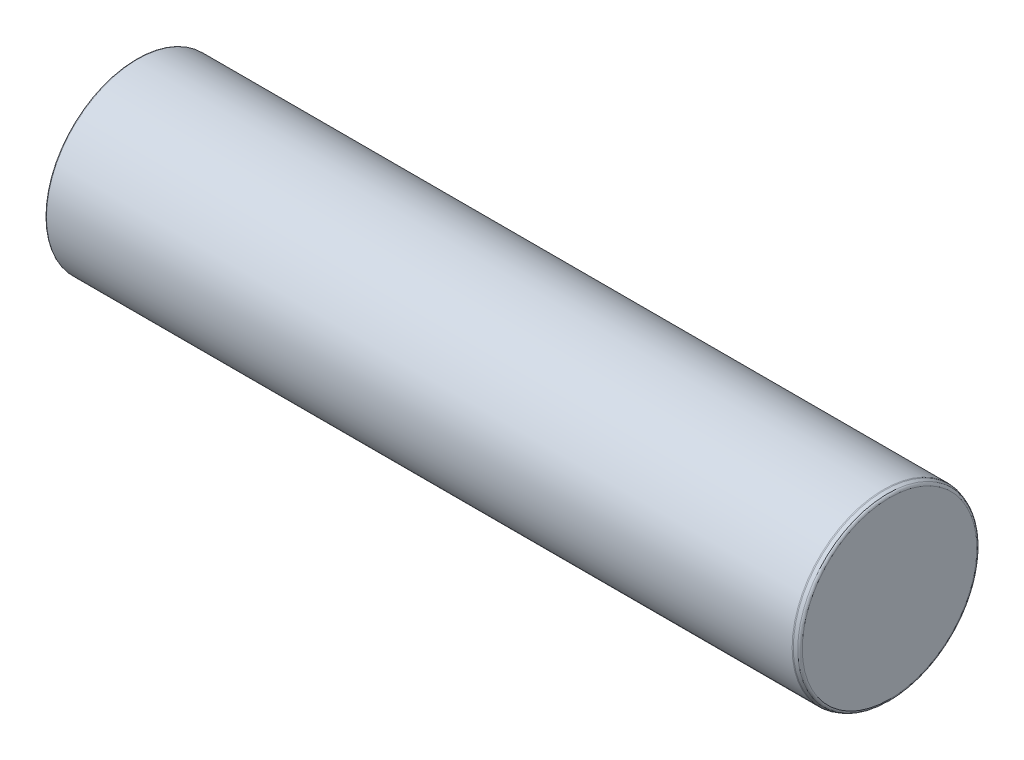
ISO-10303-21;
HEADER;
FILE_DESCRIPTION(('STEP AP214'),'2;1');
FILE_NAME('part.step','',(''),(''),'','','');
FILE_SCHEMA(('AUTOMOTIVE_DESIGN { 1 0 10303 214 1 1 1 1 }'));
ENDSEC;
DATA;
#1=APPLICATION_CONTEXT('core data for automotive mechanical design processes');
#2=APPLICATION_PROTOCOL_DEFINITION('international standard','automotive_design',2000,#1);
#3=PRODUCT_CONTEXT('',#1,'mechanical');
#4=PRODUCT('Part','Part','',(#3));
#5=PRODUCT_RELATED_PRODUCT_CATEGORY('part','',(#4));
#6=PRODUCT_DEFINITION_FORMATION('','',#4);
#7=PRODUCT_DEFINITION_CONTEXT('part definition',#1,'design');
#8=PRODUCT_DEFINITION('design','',#6,#7);
#9=PRODUCT_DEFINITION_SHAPE('','',#8);
#10=(LENGTH_UNIT() NAMED_UNIT(*) SI_UNIT(.MILLI.,.METRE.));
#11=(NAMED_UNIT(*) PLANE_ANGLE_UNIT() SI_UNIT($,.RADIAN.));
#12=(NAMED_UNIT(*) SI_UNIT($,.STERADIAN.) SOLID_ANGLE_UNIT());
#13=UNCERTAINTY_MEASURE_WITH_UNIT(LENGTH_MEASURE(1.E-05),#10,'distance_accuracy_value','');
#14=(GEOMETRIC_REPRESENTATION_CONTEXT(3) GLOBAL_UNCERTAINTY_ASSIGNED_CONTEXT((#13)) GLOBAL_UNIT_ASSIGNED_CONTEXT((#10,
#11,#12)) REPRESENTATION_CONTEXT('',''));
#15=CARTESIAN_POINT('',(0.,0.,0.));
#16=DIRECTION('',(0.,0.,1.));
#17=DIRECTION('',(1.,0.,0.));
#18=AXIS2_PLACEMENT_3D('',#15,#16,#17);
#19=CARTESIAN_POINT('',(136.5,31.0718519932579,0.));
#20=DIRECTION('',(1.,0.,0.));
#21=DIRECTION('',(0.,0.,-1.));
#22=AXIS2_PLACEMENT_3D('',#19,#20,#21);
#23=PLANE('',#22);
#24=CARTESIAN_POINT('',(136.5,0.,0.));
#25=DIRECTION('',(-1.,0.,0.));
#26=DIRECTION('',(0.,0.,1.));
#27=AXIS2_PLACEMENT_3D('',#24,#25,#26);
#28=CIRCLE('',#27,31.0718519932579);
#29=CARTESIAN_POINT('',(136.5,0.,31.0718519932579));
#30=VERTEX_POINT('',#29);
#31=EDGE_CURVE('E11',#30,#30,#28,.T.);
#32=ORIENTED_EDGE('',*,*,#31,.F.);
#33=EDGE_LOOP('',(#32));
#34=FACE_BOUND('',#33,.T.);
#35=ADVANCED_FACE('F51',(#34),#23,.T.);
#36=CARTESIAN_POINT('',(135.5,0.,0.));
#37=DIRECTION('',(-1.,0.,0.));
#38=DIRECTION('',(0.,0.,1.));
#39=AXIS2_PLACEMENT_3D('',#36,#37,#38);
#40=TOROIDAL_SURFACE('',#39,31.0718519932579,1.);
#41=CARTESIAN_POINT('',(135.842020143326,0.,0.));
#42=DIRECTION('',(-1.,0.,0.));
#43=DIRECTION('',(0.,0.,1.));
#44=AXIS2_PLACEMENT_3D('',#41,#42,#43);
#45=CIRCLE('',#44,32.0115446140438);
#46=CARTESIAN_POINT('',(135.842020143326,0.,32.0115446140438));
#47=VERTEX_POINT('',#46);
#48=EDGE_CURVE('E57',#47,#47,#45,.T.);
#49=ORIENTED_EDGE('',*,*,#48,.F.);
#50=EDGE_LOOP('',(#49));
#51=FACE_BOUND('',#50,.T.);
#52=ORIENTED_EDGE('',*,*,#31,.T.);
#53=EDGE_LOOP('',(#52));
#54=FACE_BOUND('',#53,.T.);
#55=ADVANCED_FACE('F111',(#51,#54),#40,.T.);
#56=CARTESIAN_POINT('',(135.842020143326,0.,0.));
#57=DIRECTION('',(-1.,0.,0.));
#58=DIRECTION('',(0.,0.,1.));
#59=AXIS2_PLACEMENT_3D('',#56,#57,#58);
#60=CONICAL_SURFACE('',#59,32.0115446140438,0.349065850398857);
#61=CARTESIAN_POINT('',(134.665693162617,0.,0.));
#62=DIRECTION('',(-1.,0.,0.));
#63=DIRECTION('',(0.,0.,1.));
#64=AXIS2_PLACEMENT_3D('',#61,#62,#63);
#65=CIRCLE('',#64,32.4396926207859);
#66=CARTESIAN_POINT('',(134.665693162617,0.,32.4396926207859));
#67=VERTEX_POINT('',#66);
#68=EDGE_CURVE('E104',#67,#67,#65,.T.);
#69=ORIENTED_EDGE('',*,*,#68,.F.);
#70=EDGE_LOOP('',(#69));
#71=FACE_BOUND('',#70,.T.);
#72=ORIENTED_EDGE('',*,*,#48,.T.);
#73=EDGE_LOOP('',(#72));
#74=FACE_BOUND('',#73,.T.);
#75=ADVANCED_FACE('F109',(#71,#74),#60,.T.);
#76=CARTESIAN_POINT('',(134.323673019292,0.,0.));
#77=DIRECTION('',(-1.,0.,0.));
#78=DIRECTION('',(0.,0.,1.));
#79=AXIS2_PLACEMENT_3D('',#76,#77,#78);
#80=TOROIDAL_SURFACE('',#79,31.5,1.00000000000001);
#81=CARTESIAN_POINT('',(134.323673019292,0.,0.));
#82=DIRECTION('',(-1.,0.,0.));
#83=DIRECTION('',(0.,0.,1.));
#84=AXIS2_PLACEMENT_3D('',#81,#82,#83);
#85=CIRCLE('',#84,32.5);
#86=CARTESIAN_POINT('',(134.323673019292,0.,32.5));
#87=VERTEX_POINT('',#86);
#88=EDGE_CURVE('E101',#87,#87,#85,.T.);
#89=ORIENTED_EDGE('',*,*,#88,.F.);
#90=EDGE_LOOP('',(#89));
#91=FACE_BOUND('',#90,.T.);
#92=ORIENTED_EDGE('',*,*,#68,.T.);
#93=EDGE_LOOP('',(#92));
#94=FACE_BOUND('',#93,.T.);
#95=ADVANCED_FACE('F129',(#91,#94),#80,.T.);
#96=CARTESIAN_POINT('',(-136.5,0.,0.));
#97=DIRECTION('',(-1.,0.,0.));
#98=DIRECTION('',(0.,0.,1.));
#99=AXIS2_PLACEMENT_3D('',#96,#97,#98);
#100=CYLINDRICAL_SURFACE('',#99,32.5);
#101=CARTESIAN_POINT('',(-131.1,0.,0.));
#102=DIRECTION('',(-1.,0.,0.));
#103=DIRECTION('',(0.,0.,1.));
#104=AXIS2_PLACEMENT_3D('',#101,#102,#103);
#105=CIRCLE('',#104,32.5);
#106=CARTESIAN_POINT('',(-131.1,0.,32.5));
#107=VERTEX_POINT('',#106);
#108=EDGE_CURVE('E98',#107,#107,#105,.T.);
#109=ORIENTED_EDGE('',*,*,#108,.F.);
#110=EDGE_LOOP('',(#109));
#111=FACE_BOUND('',#110,.T.);
#112=ORIENTED_EDGE('',*,*,#88,.T.);
#113=EDGE_LOOP('',(#112));
#114=FACE_BOUND('',#113,.T.);
#115=ADVANCED_FACE('F137',(#111,#114),#100,.T.);
#116=CARTESIAN_POINT('',(-131.1,0.,0.));
#117=DIRECTION('',(-1.,0.,0.));
#118=DIRECTION('',(0.,0.,1.));
#119=AXIS2_PLACEMENT_3D('',#116,#117,#118);
#120=TOROIDAL_SURFACE('',#119,32.1,0.400000000000001);
#121=ORIENTED_EDGE('',*,*,#108,.T.);
#122=EDGE_LOOP('',(#121));
#123=FACE_BOUND('',#122,.T.);
#124=CARTESIAN_POINT('',(-131.5,0.,0.));
#125=DIRECTION('',(-1.,0.,0.));
#126=DIRECTION('',(0.,0.,1.));
#127=AXIS2_PLACEMENT_3D('',#124,#125,#126);
#128=CIRCLE('',#127,32.1);
#129=CARTESIAN_POINT('',(-131.5,0.,32.1));
#130=VERTEX_POINT('',#129);
#131=EDGE_CURVE('E95',#130,#130,#128,.T.);
#132=ORIENTED_EDGE('',*,*,#131,.F.);
#133=EDGE_LOOP('',(#132));
#134=FACE_BOUND('',#133,.T.);
#135=ADVANCED_FACE('F146',(#123,#134),#120,.T.);
#136=CARTESIAN_POINT('',(-131.5,32.1,0.));
#137=DIRECTION('',(1.,0.,0.));
#138=DIRECTION('',(0.,0.,-1.));
#139=AXIS2_PLACEMENT_3D('',#136,#137,#138);
#140=PLANE('',#139);
#141=CARTESIAN_POINT('',(-131.5,0.,0.));
#142=DIRECTION('',(-1.,0.,0.));
#143=DIRECTION('',(0.,0.,1.));
#144=AXIS2_PLACEMENT_3D('',#141,#142,#143);
#145=CIRCLE('',#144,28.4);
#146=CARTESIAN_POINT('',(-131.5,0.,28.4));
#147=VERTEX_POINT('',#146);
#148=EDGE_CURVE('E92',#147,#147,#145,.T.);
#149=ORIENTED_EDGE('',*,*,#148,.F.);
#150=EDGE_LOOP('',(#149));
#151=FACE_BOUND('',#150,.T.);
#152=ORIENTED_EDGE('',*,*,#131,.T.);
#153=EDGE_LOOP('',(#152));
#154=FACE_BOUND('',#153,.T.);
#155=ADVANCED_FACE('F154',(#151,#154),#140,.F.);
#156=CARTESIAN_POINT('',(-131.9,0.,0.));
#157=DIRECTION('',(-1.,0.,0.));
#158=DIRECTION('',(0.,0.,1.));
#159=AXIS2_PLACEMENT_3D('',#156,#157,#158);
#160=TOROIDAL_SURFACE('',#159,28.4,0.400000000000005);
#161=ORIENTED_EDGE('',*,*,#148,.T.);
#162=EDGE_LOOP('',(#161));
#163=FACE_BOUND('',#162,.T.);
#164=CARTESIAN_POINT('',(-131.9,0.,0.));
#165=DIRECTION('',(-1.,0.,0.));
#166=DIRECTION('',(0.,0.,1.));
#167=AXIS2_PLACEMENT_3D('',#164,#165,#166);
#168=CIRCLE('',#167,28.);
#169=CARTESIAN_POINT('',(-131.9,0.,28.));
#170=VERTEX_POINT('',#169);
#171=EDGE_CURVE('E89',#170,#170,#168,.T.);
#172=ORIENTED_EDGE('',*,*,#171,.F.);
#173=EDGE_LOOP('',(#172));
#174=FACE_BOUND('',#173,.T.);
#175=ADVANCED_FACE('F162',(#163,#174),#160,.F.);
#176=CARTESIAN_POINT('',(-136.5,0.,0.));
#177=DIRECTION('',(-1.,0.,0.));
#178=DIRECTION('',(0.,0.,1.));
#179=AXIS2_PLACEMENT_3D('',#176,#177,#178);
#180=CYLINDRICAL_SURFACE('',#179,28.0000000000003);
#181=CARTESIAN_POINT('',(-132.5,0.,0.));
#182=DIRECTION('',(-1.,0.,0.));
#183=DIRECTION('',(0.,0.,1.));
#184=AXIS2_PLACEMENT_3D('',#181,#182,#183);
#185=CIRCLE('',#184,28.0000000000005);
#186=CARTESIAN_POINT('',(-132.5,0.,28.0000000000005));
#187=VERTEX_POINT('',#186);
#188=EDGE_CURVE('E86',#187,#187,#185,.T.);
#189=ORIENTED_EDGE('',*,*,#188,.F.);
#190=EDGE_LOOP('',(#189));
#191=FACE_BOUND('',#190,.T.);
#192=ORIENTED_EDGE('',*,*,#171,.T.);
#193=EDGE_LOOP('',(#192));
#194=FACE_BOUND('',#193,.T.);
#195=ADVANCED_FACE('F170',(#191,#194),#180,.T.);
#196=CARTESIAN_POINT('',(-132.5,28.0000000000005,0.));
#197=DIRECTION('',(1.,0.,0.));
#198=DIRECTION('',(0.,0.,-1.));
#199=AXIS2_PLACEMENT_3D('',#196,#197,#198);
#200=PLANE('',#199);
#201=CARTESIAN_POINT('',(-132.5,0.,0.));
#202=DIRECTION('',(-1.,0.,0.));
#203=DIRECTION('',(0.,0.,1.));
#204=AXIS2_PLACEMENT_3D('',#201,#202,#203);
#205=CIRCLE('',#204,25.2309401076756);
#206=CARTESIAN_POINT('',(-132.5,0.,25.2309401076756));
#207=VERTEX_POINT('',#206);
#208=EDGE_CURVE('E83',#207,#207,#205,.T.);
#209=ORIENTED_EDGE('',*,*,#208,.F.);
#210=EDGE_LOOP('',(#209));
#211=FACE_BOUND('',#210,.T.);
#212=ORIENTED_EDGE('',*,*,#188,.T.);
#213=EDGE_LOOP('',(#212));
#214=FACE_BOUND('',#213,.T.);
#215=ADVANCED_FACE('F178',(#211,#214),#200,.F.);
#216=CARTESIAN_POINT('',(-132.9,0.,0.));
#217=DIRECTION('',(-1.,0.,0.));
#218=DIRECTION('',(0.,0.,1.));
#219=AXIS2_PLACEMENT_3D('',#216,#217,#218);
#220=TOROIDAL_SURFACE('',#219,25.2309401076756,0.400000000000002);
#221=ORIENTED_EDGE('',*,*,#208,.T.);
#222=EDGE_LOOP('',(#221));
#223=FACE_BOUND('',#222,.T.);
#224=CARTESIAN_POINT('',(-132.7,0.,0.));
#225=DIRECTION('',(-1.,0.,0.));
#226=DIRECTION('',(0.,0.,1.));
#227=AXIS2_PLACEMENT_3D('',#224,#225,#226);
#228=CIRCLE('',#227,24.884529946162);
#229=CARTESIAN_POINT('',(-132.7,0.,24.884529946162));
#230=VERTEX_POINT('',#229);
#231=EDGE_CURVE('E80',#230,#230,#228,.T.);
#232=ORIENTED_EDGE('',*,*,#231,.F.);
#233=EDGE_LOOP('',(#232));
#234=FACE_BOUND('',#233,.T.);
#235=ADVANCED_FACE('F186',(#223,#234),#220,.F.);
#236=CARTESIAN_POINT('',(-132.7,0.,0.));
#237=DIRECTION('',(1.,0.,0.));
#238=DIRECTION('',(0.,0.,-1.));
#239=AXIS2_PLACEMENT_3D('',#236,#237,#238);
#240=CONICAL_SURFACE('',#239,24.884529946162,0.523598775599158);
#241=CARTESIAN_POINT('',(-136.3,0.,0.));
#242=DIRECTION('',(-1.,0.,0.));
#243=DIRECTION('',(0.,0.,1.));
#244=AXIS2_PLACEMENT_3D('',#241,#242,#243);
#245=CIRCLE('',#244,22.8060689770749);
#246=CARTESIAN_POINT('',(-136.3,0.,22.8060689770749));
#247=VERTEX_POINT('',#246);
#248=EDGE_CURVE('E77',#247,#247,#245,.T.);
#249=ORIENTED_EDGE('',*,*,#248,.F.);
#250=EDGE_LOOP('',(#249));
#251=FACE_BOUND('',#250,.T.);
#252=ORIENTED_EDGE('',*,*,#231,.T.);
#253=EDGE_LOOP('',(#252));
#254=FACE_BOUND('',#253,.T.);
#255=ADVANCED_FACE('F194',(#251,#254),#240,.T.);
#256=CARTESIAN_POINT('',(-136.1,0.,0.));
#257=DIRECTION('',(-1.,0.,0.));
#258=DIRECTION('',(0.,0.,1.));
#259=AXIS2_PLACEMENT_3D('',#256,#257,#258);
#260=TOROIDAL_SURFACE('',#259,22.4596588155613,0.4);
#261=CARTESIAN_POINT('',(-136.5,0.,0.));
#262=DIRECTION('',(-1.,0.,0.));
#263=DIRECTION('',(0.,0.,1.));
#264=AXIS2_PLACEMENT_3D('',#261,#262,#263);
#265=CIRCLE('',#264,22.4596588155613);
#266=CARTESIAN_POINT('',(-136.5,0.,22.4596588155613));
#267=VERTEX_POINT('',#266);
#268=EDGE_CURVE('E72',#267,#267,#265,.T.);
#269=ORIENTED_EDGE('',*,*,#268,.F.);
#270=EDGE_LOOP('',(#269));
#271=FACE_BOUND('',#270,.T.);
#272=ORIENTED_EDGE('',*,*,#248,.T.);
#273=EDGE_LOOP('',(#272));
#274=FACE_BOUND('',#273,.T.);
#275=ADVANCED_FACE('F202',(#271,#274),#260,.T.);
#276=CARTESIAN_POINT('',(-136.5,22.4596588155613,0.));
#277=DIRECTION('',(1.,0.,0.));
#278=DIRECTION('',(0.,0.,-1.));
#279=AXIS2_PLACEMENT_3D('',#276,#277,#278);
#280=PLANE('',#279);
#281=CARTESIAN_POINT('',(-136.5,0.,0.));
#282=DIRECTION('',(-1.,0.,0.));
#283=DIRECTION('',(0.,0.,1.));
#284=AXIS2_PLACEMENT_3D('',#281,#282,#283);
#285=CIRCLE('',#284,5.1);
#286=CARTESIAN_POINT('',(-136.5,0.,5.1));
#287=VERTEX_POINT('',#286);
#288=EDGE_CURVE('E69',#287,#287,#285,.T.);
#289=ORIENTED_EDGE('',*,*,#288,.F.);
#290=EDGE_LOOP('',(#289));
#291=FACE_BOUND('',#290,.T.);
#292=ORIENTED_EDGE('',*,*,#268,.T.);
#293=EDGE_LOOP('',(#292));
#294=FACE_BOUND('',#293,.T.);
#295=ADVANCED_FACE('F210',(#291,#294),#280,.F.);
#296=CARTESIAN_POINT('',(-136.5,0.,0.));
#297=DIRECTION('',(-1.,0.,0.));
#298=DIRECTION('',(0.,0.,1.));
#299=AXIS2_PLACEMENT_3D('',#296,#297,#298);
#300=CYLINDRICAL_SURFACE('',#299,5.1);
#301=CARTESIAN_POINT('',(-116.5,0.,0.));
#302=DIRECTION('',(-1.,0.,0.));
#303=DIRECTION('',(0.,0.,1.));
#304=AXIS2_PLACEMENT_3D('',#301,#302,#303);
#305=CIRCLE('',#304,5.1);
#306=CARTESIAN_POINT('',(-116.5,0.,5.1));
#307=VERTEX_POINT('',#306);
#308=EDGE_CURVE('E67',#307,#307,#305,.T.);
#309=ORIENTED_EDGE('',*,*,#308,.F.);
#310=EDGE_LOOP('',(#309));
#311=FACE_BOUND('',#310,.T.);
#312=ORIENTED_EDGE('',*,*,#288,.T.);
#313=EDGE_LOOP('',(#312));
#314=FACE_BOUND('',#313,.T.);
#315=ADVANCED_FACE('F63',(#311,#314),#300,.F.);
#316=CARTESIAN_POINT('',(-116.5,0.,0.));
#317=DIRECTION('',(-1.,0.,0.));
#318=DIRECTION('',(0.,0.,1.));
#319=AXIS2_PLACEMENT_3D('',#316,#317,#318);
#320=CONICAL_SURFACE('',#319,5.1,1.0471975511966);
#321=CARTESIAN_POINT('',(-113.555513627133,0.,0.));
#322=VERTEX_POINT('',#321);
#323=VERTEX_LOOP('',#322);
#324=FACE_BOUND('',#323,.T.);
#325=ORIENTED_EDGE('',*,*,#308,.T.);
#326=EDGE_LOOP('',(#325));
#327=FACE_BOUND('',#326,.T.);
#328=ADVANCED_FACE('F60',(#324,#327),#320,.F.);
#329=CLOSED_SHELL('',(#35,#55,#75,#95,#115,#135,#155,#175,#195,#215,#235,#255,#275,#295,#315,#328));
#330=MANIFOLD_SOLID_BREP('B2',#329);
#331=ADVANCED_BREP_SHAPE_REPRESENTATION('',(#18,#330),#14);
#332=SHAPE_DEFINITION_REPRESENTATION(#9,#331);
ENDSEC;
END-ISO-10303-21;
